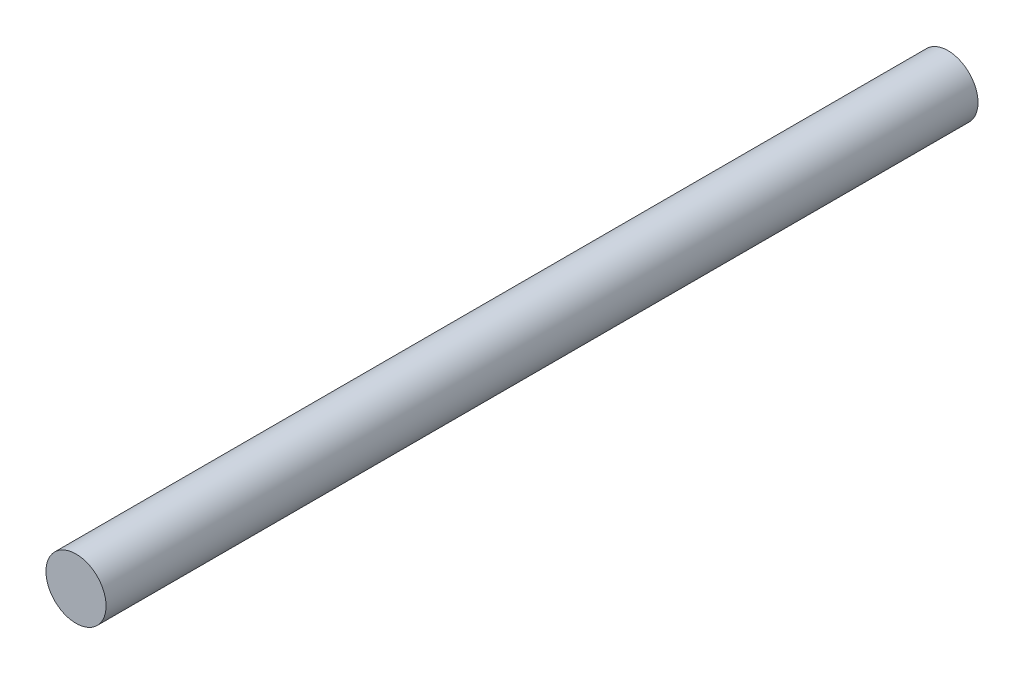
ISO-10303-21;
HEADER;
FILE_DESCRIPTION(('STEP AP214'),'2;1');
FILE_NAME('part.step','',(''),(''),'','','');
FILE_SCHEMA(('AUTOMOTIVE_DESIGN { 1 0 10303 214 1 1 1 1 }'));
ENDSEC;
DATA;
#1=APPLICATION_CONTEXT('core data for automotive mechanical design processes');
#2=APPLICATION_PROTOCOL_DEFINITION('international standard','automotive_design',2000,#1);
#3=PRODUCT_CONTEXT('',#1,'mechanical');
#4=PRODUCT('Part','Part','',(#3));
#5=PRODUCT_RELATED_PRODUCT_CATEGORY('part','',(#4));
#6=PRODUCT_DEFINITION_FORMATION('','',#4);
#7=PRODUCT_DEFINITION_CONTEXT('part definition',#1,'design');
#8=PRODUCT_DEFINITION('design','',#6,#7);
#9=PRODUCT_DEFINITION_SHAPE('','',#8);
#10=(LENGTH_UNIT() NAMED_UNIT(*) SI_UNIT(.MILLI.,.METRE.));
#11=(NAMED_UNIT(*) PLANE_ANGLE_UNIT() SI_UNIT($,.RADIAN.));
#12=(NAMED_UNIT(*) SI_UNIT($,.STERADIAN.) SOLID_ANGLE_UNIT());
#13=UNCERTAINTY_MEASURE_WITH_UNIT(LENGTH_MEASURE(1.E-05),#10,'distance_accuracy_value','');
#14=(GEOMETRIC_REPRESENTATION_CONTEXT(3) GLOBAL_UNCERTAINTY_ASSIGNED_CONTEXT((#13)) GLOBAL_UNIT_ASSIGNED_CONTEXT((#10,
#11,#12)) REPRESENTATION_CONTEXT('',''));
#15=CARTESIAN_POINT('',(0.,0.,0.));
#16=DIRECTION('',(0.,0.,1.));
#17=DIRECTION('',(1.,0.,0.));
#18=AXIS2_PLACEMENT_3D('',#15,#16,#17);
#19=CARTESIAN_POINT('',(0.,0.,145.));
#20=DIRECTION('',(0.,0.,-1.));
#21=DIRECTION('',(-1.,0.,0.));
#22=AXIS2_PLACEMENT_3D('',#19,#20,#21);
#23=CYLINDRICAL_SURFACE('',#22,5.);
#24=CARTESIAN_POINT('',(0.,0.,145.));
#25=DIRECTION('',(0.,0.,1.));
#26=DIRECTION('',(1.,0.,0.));
#27=AXIS2_PLACEMENT_3D('',#24,#25,#26);
#28=CIRCLE('',#27,5.);
#29=CARTESIAN_POINT('',(5.,0.,145.));
#30=VERTEX_POINT('',#29);
#31=EDGE_CURVE('E10',#30,#30,#28,.T.);
#32=ORIENTED_EDGE('',*,*,#31,.F.);
#33=EDGE_LOOP('',(#32));
#34=FACE_BOUND('',#33,.T.);
#35=CARTESIAN_POINT('',(0.,0.,0.));
#36=DIRECTION('',(0.,0.,1.));
#37=DIRECTION('',(1.,0.,0.));
#38=AXIS2_PLACEMENT_3D('',#35,#36,#37);
#39=CIRCLE('',#38,5.);
#40=CARTESIAN_POINT('',(5.,0.,0.));
#41=VERTEX_POINT('',#40);
#42=EDGE_CURVE('E40',#41,#41,#39,.T.);
#43=ORIENTED_EDGE('',*,*,#42,.T.);
#44=EDGE_LOOP('',(#43));
#45=FACE_BOUND('',#44,.T.);
#46=ADVANCED_FACE('F37',(#34,#45),#23,.T.);
#47=CARTESIAN_POINT('',(0.,0.,145.));
#48=DIRECTION('',(0.,0.,1.));
#49=DIRECTION('',(1.,0.,0.));
#50=AXIS2_PLACEMENT_3D('',#47,#48,#49);
#51=PLANE('',#50);
#52=ORIENTED_EDGE('',*,*,#31,.T.);
#53=EDGE_LOOP('',(#52));
#54=FACE_BOUND('',#53,.T.);
#55=ADVANCED_FACE('F52',(#54),#51,.T.);
#56=CARTESIAN_POINT('',(0.,0.,0.));
#57=DIRECTION('',(0.,0.,1.));
#58=DIRECTION('',(1.,0.,0.));
#59=AXIS2_PLACEMENT_3D('',#56,#57,#58);
#60=PLANE('',#59);
#61=ORIENTED_EDGE('',*,*,#42,.F.);
#62=EDGE_LOOP('',(#61));
#63=FACE_BOUND('',#62,.T.);
#64=ADVANCED_FACE('F50',(#63),#60,.F.);
#65=CLOSED_SHELL('',(#46,#55,#64));
#66=MANIFOLD_SOLID_BREP('B2',#65);
#67=ADVANCED_BREP_SHAPE_REPRESENTATION('',(#18,#66),#14);
#68=SHAPE_DEFINITION_REPRESENTATION(#9,#67);
ENDSEC;
END-ISO-10303-21;
